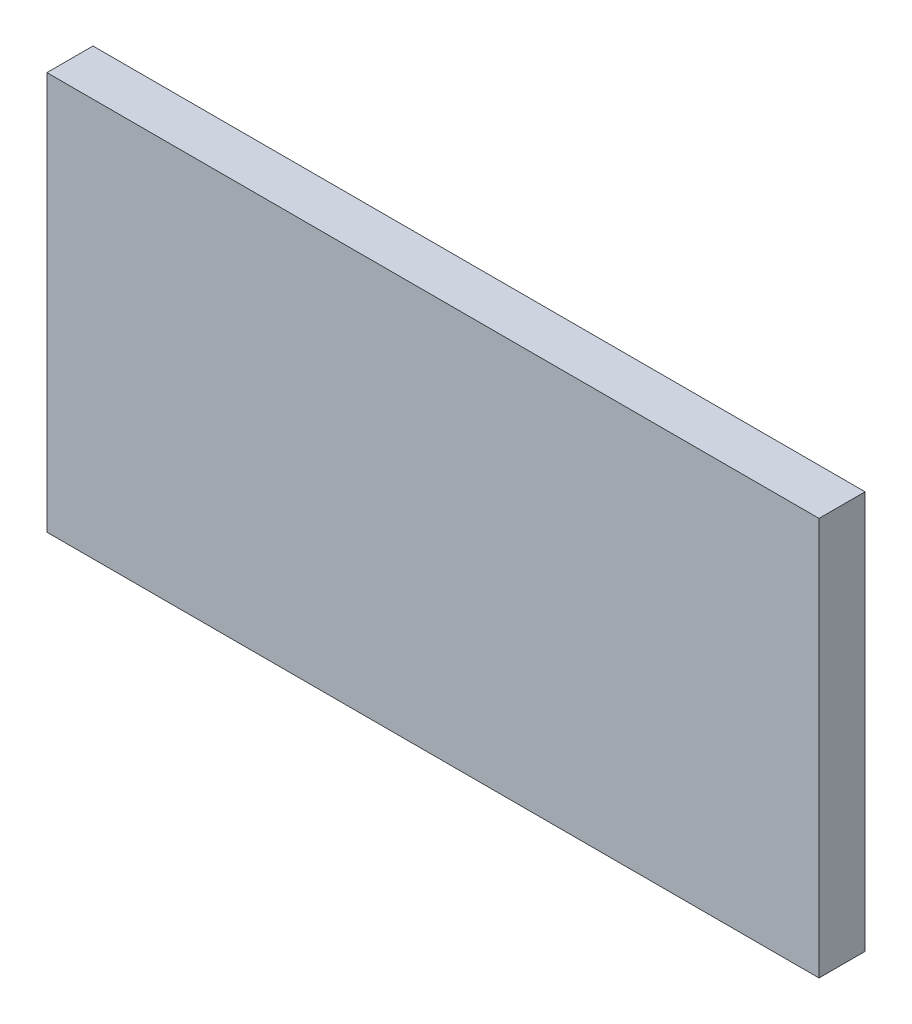
ISO-10303-21;
HEADER;
FILE_DESCRIPTION(('STEP AP214'),'2;1');
FILE_NAME('part.step','',(''),(''),'','','');
FILE_SCHEMA(('AUTOMOTIVE_DESIGN { 1 0 10303 214 1 1 1 1 }'));
ENDSEC;
DATA;
#1=APPLICATION_CONTEXT('core data for automotive mechanical design processes');
#2=APPLICATION_PROTOCOL_DEFINITION('international standard','automotive_design',2000,#1);
#3=PRODUCT_CONTEXT('',#1,'mechanical');
#4=PRODUCT('Part','Part','',(#3));
#5=PRODUCT_RELATED_PRODUCT_CATEGORY('part','',(#4));
#6=PRODUCT_DEFINITION_FORMATION('','',#4);
#7=PRODUCT_DEFINITION_CONTEXT('part definition',#1,'design');
#8=PRODUCT_DEFINITION('design','',#6,#7);
#9=PRODUCT_DEFINITION_SHAPE('','',#8);
#10=(LENGTH_UNIT() NAMED_UNIT(*) SI_UNIT(.MILLI.,.METRE.));
#11=(NAMED_UNIT(*) PLANE_ANGLE_UNIT() SI_UNIT($,.RADIAN.));
#12=(NAMED_UNIT(*) SI_UNIT($,.STERADIAN.) SOLID_ANGLE_UNIT());
#13=UNCERTAINTY_MEASURE_WITH_UNIT(LENGTH_MEASURE(1.E-05),#10,'distance_accuracy_value','');
#14=(GEOMETRIC_REPRESENTATION_CONTEXT(3) GLOBAL_UNCERTAINTY_ASSIGNED_CONTEXT((#13)) GLOBAL_UNIT_ASSIGNED_CONTEXT((#10,
#11,#12)) REPRESENTATION_CONTEXT('',''));
#15=CARTESIAN_POINT('',(0.,0.,0.));
#16=DIRECTION('',(0.,0.,1.));
#17=DIRECTION('',(1.,0.,0.));
#18=AXIS2_PLACEMENT_3D('',#15,#16,#17);
#19=CARTESIAN_POINT('',(-0.838,-0.432,0.1));
#20=DIRECTION('',(0.,0.,-1.));
#21=DIRECTION('',(-1.,0.,0.));
#22=AXIS2_PLACEMENT_3D('',#19,#20,#21);
#23=PLANE('',#22);
#24=DIRECTION('',(0.,1.,0.));
#25=VECTOR('',#24,1.);
#26=CARTESIAN_POINT('',(0.838,-0.432,0.1));
#27=LINE('',#26,#25);
#28=CARTESIAN_POINT('',(0.838,-0.432,0.1));
#29=VERTEX_POINT('',#28);
#30=CARTESIAN_POINT('',(0.838,0.432,0.1));
#31=VERTEX_POINT('',#30);
#32=EDGE_CURVE('E55',#29,#31,#27,.T.);
#33=ORIENTED_EDGE('',*,*,#32,.T.);
#34=DIRECTION('',(1.,0.,0.));
#35=VECTOR('',#34,1.);
#36=CARTESIAN_POINT('',(0.838,0.432,0.1));
#37=LINE('',#36,#35);
#38=CARTESIAN_POINT('',(-0.838,0.432,0.1));
#39=VERTEX_POINT('',#38);
#40=EDGE_CURVE('E57',#31,#39,#37,.F.);
#41=ORIENTED_EDGE('',*,*,#40,.T.);
#42=DIRECTION('',(0.,1.,0.));
#43=VECTOR('',#42,1.);
#44=CARTESIAN_POINT('',(-0.838,0.432,0.1));
#45=LINE('',#44,#43);
#46=CARTESIAN_POINT('',(-0.838,-0.432,0.1));
#47=VERTEX_POINT('',#46);
#48=EDGE_CURVE('E20',#39,#47,#45,.F.);
#49=ORIENTED_EDGE('',*,*,#48,.T.);
#50=DIRECTION('',(1.,0.,0.));
#51=VECTOR('',#50,1.);
#52=CARTESIAN_POINT('',(-0.838,-0.432,0.1));
#53=LINE('',#52,#51);
#54=EDGE_CURVE('E80',#47,#29,#53,.T.);
#55=ORIENTED_EDGE('',*,*,#54,.T.);
#56=EDGE_LOOP('',(#33,#41,#49,#55));
#57=FACE_BOUND('',#56,.T.);
#58=ADVANCED_FACE('F17',(#57),#23,.F.);
#59=CARTESIAN_POINT('',(-0.838,0.432,0.));
#60=DIRECTION('',(1.,0.,0.));
#61=DIRECTION('',(0.,0.,-1.));
#62=AXIS2_PLACEMENT_3D('',#59,#60,#61);
#63=PLANE('',#62);
#64=DIRECTION('',(0.,0.,1.));
#65=VECTOR('',#64,1.);
#66=CARTESIAN_POINT('',(-0.838,-0.432,0.));
#67=LINE('',#66,#65);
#68=CARTESIAN_POINT('',(-0.838,-0.432,0.));
#69=VERTEX_POINT('',#68);
#70=EDGE_CURVE('E68',#69,#47,#67,.T.);
#71=ORIENTED_EDGE('',*,*,#70,.T.);
#72=ORIENTED_EDGE('',*,*,#48,.F.);
#73=DIRECTION('',(0.,0.,-1.));
#74=VECTOR('',#73,1.);
#75=CARTESIAN_POINT('',(-0.838,0.432,0.));
#76=LINE('',#75,#74);
#77=CARTESIAN_POINT('',(-0.838,0.432,0.));
#78=VERTEX_POINT('',#77);
#79=EDGE_CURVE('E63',#39,#78,#76,.T.);
#80=ORIENTED_EDGE('',*,*,#79,.T.);
#81=DIRECTION('',(0.,1.,0.));
#82=VECTOR('',#81,1.);
#83=CARTESIAN_POINT('',(-0.838,-0.432,0.));
#84=LINE('',#83,#82);
#85=EDGE_CURVE('E83',#69,#78,#84,.T.);
#86=ORIENTED_EDGE('',*,*,#85,.F.);
#87=EDGE_LOOP('',(#71,#72,#80,#86));
#88=FACE_BOUND('',#87,.T.);
#89=ADVANCED_FACE('F65',(#88),#63,.F.);
#90=CARTESIAN_POINT('',(0.838,0.432,0.));
#91=DIRECTION('',(0.,-1.,0.));
#92=DIRECTION('',(0.,0.,-1.));
#93=AXIS2_PLACEMENT_3D('',#90,#91,#92);
#94=PLANE('',#93);
#95=ORIENTED_EDGE('',*,*,#79,.F.);
#96=ORIENTED_EDGE('',*,*,#40,.F.);
#97=DIRECTION('',(0.,0.,1.));
#98=VECTOR('',#97,1.);
#99=CARTESIAN_POINT('',(0.838,0.432,0.));
#100=LINE('',#99,#98);
#101=CARTESIAN_POINT('',(0.838,0.432,0.));
#102=VERTEX_POINT('',#101);
#103=EDGE_CURVE('E75',#31,#102,#100,.F.);
#104=ORIENTED_EDGE('',*,*,#103,.T.);
#105=DIRECTION('',(-1.,0.,0.));
#106=VECTOR('',#105,1.);
#107=CARTESIAN_POINT('',(-0.838,0.432,0.));
#108=LINE('',#107,#106);
#109=EDGE_CURVE('E72',#78,#102,#108,.F.);
#110=ORIENTED_EDGE('',*,*,#109,.F.);
#111=EDGE_LOOP('',(#95,#96,#104,#110));
#112=FACE_BOUND('',#111,.T.);
#113=ADVANCED_FACE('F70',(#112),#94,.F.);
#114=CARTESIAN_POINT('',(0.838,-0.432,0.));
#115=DIRECTION('',(-1.,0.,0.));
#116=DIRECTION('',(0.,0.,1.));
#117=AXIS2_PLACEMENT_3D('',#114,#115,#116);
#118=PLANE('',#117);
#119=ORIENTED_EDGE('',*,*,#103,.F.);
#120=ORIENTED_EDGE('',*,*,#32,.F.);
#121=DIRECTION('',(0.,0.,1.));
#122=VECTOR('',#121,1.);
#123=CARTESIAN_POINT('',(0.838,-0.432,0.));
#124=LINE('',#123,#122);
#125=CARTESIAN_POINT('',(0.838,-0.432,0.));
#126=VERTEX_POINT('',#125);
#127=EDGE_CURVE('E35',#29,#126,#124,.F.);
#128=ORIENTED_EDGE('',*,*,#127,.T.);
#129=DIRECTION('',(0.,1.,0.));
#130=VECTOR('',#129,1.);
#131=CARTESIAN_POINT('',(0.838,-0.432,0.));
#132=LINE('',#131,#130);
#133=EDGE_CURVE('E26',#102,#126,#132,.F.);
#134=ORIENTED_EDGE('',*,*,#133,.F.);
#135=EDGE_LOOP('',(#119,#120,#128,#134));
#136=FACE_BOUND('',#135,.T.);
#137=ADVANCED_FACE('F89',(#136),#118,.F.);
#138=CARTESIAN_POINT('',(-0.838,-0.432,0.));
#139=DIRECTION('',(0.,1.,0.));
#140=DIRECTION('',(0.,0.,1.));
#141=AXIS2_PLACEMENT_3D('',#138,#139,#140);
#142=PLANE('',#141);
#143=ORIENTED_EDGE('',*,*,#127,.F.);
#144=ORIENTED_EDGE('',*,*,#54,.F.);
#145=ORIENTED_EDGE('',*,*,#70,.F.);
#146=DIRECTION('',(-1.,0.,0.));
#147=VECTOR('',#146,1.);
#148=CARTESIAN_POINT('',(-0.838,-0.432,0.));
#149=LINE('',#148,#147);
#150=EDGE_CURVE('E11',#126,#69,#149,.T.);
#151=ORIENTED_EDGE('',*,*,#150,.F.);
#152=EDGE_LOOP('',(#143,#144,#145,#151));
#153=FACE_BOUND('',#152,.T.);
#154=ADVANCED_FACE('F91',(#153),#142,.F.);
#155=CARTESIAN_POINT('',(-0.838,-0.432,0.));
#156=DIRECTION('',(0.,0.,-1.));
#157=DIRECTION('',(-1.,0.,0.));
#158=AXIS2_PLACEMENT_3D('',#155,#156,#157);
#159=PLANE('',#158);
#160=ORIENTED_EDGE('',*,*,#133,.T.);
#161=ORIENTED_EDGE('',*,*,#150,.T.);
#162=ORIENTED_EDGE('',*,*,#85,.T.);
#163=ORIENTED_EDGE('',*,*,#109,.T.);
#164=EDGE_LOOP('',(#160,#161,#162,#163));
#165=FACE_BOUND('',#164,.T.);
#166=ADVANCED_FACE('F88',(#165),#159,.T.);
#167=CLOSED_SHELL('',(#58,#89,#113,#137,#154,#166));
#168=MANIFOLD_SOLID_BREP('B1',#167);
#169=ADVANCED_BREP_SHAPE_REPRESENTATION('',(#18,#168),#14);
#170=SHAPE_DEFINITION_REPRESENTATION(#9,#169);
ENDSEC;
END-ISO-10303-21;
